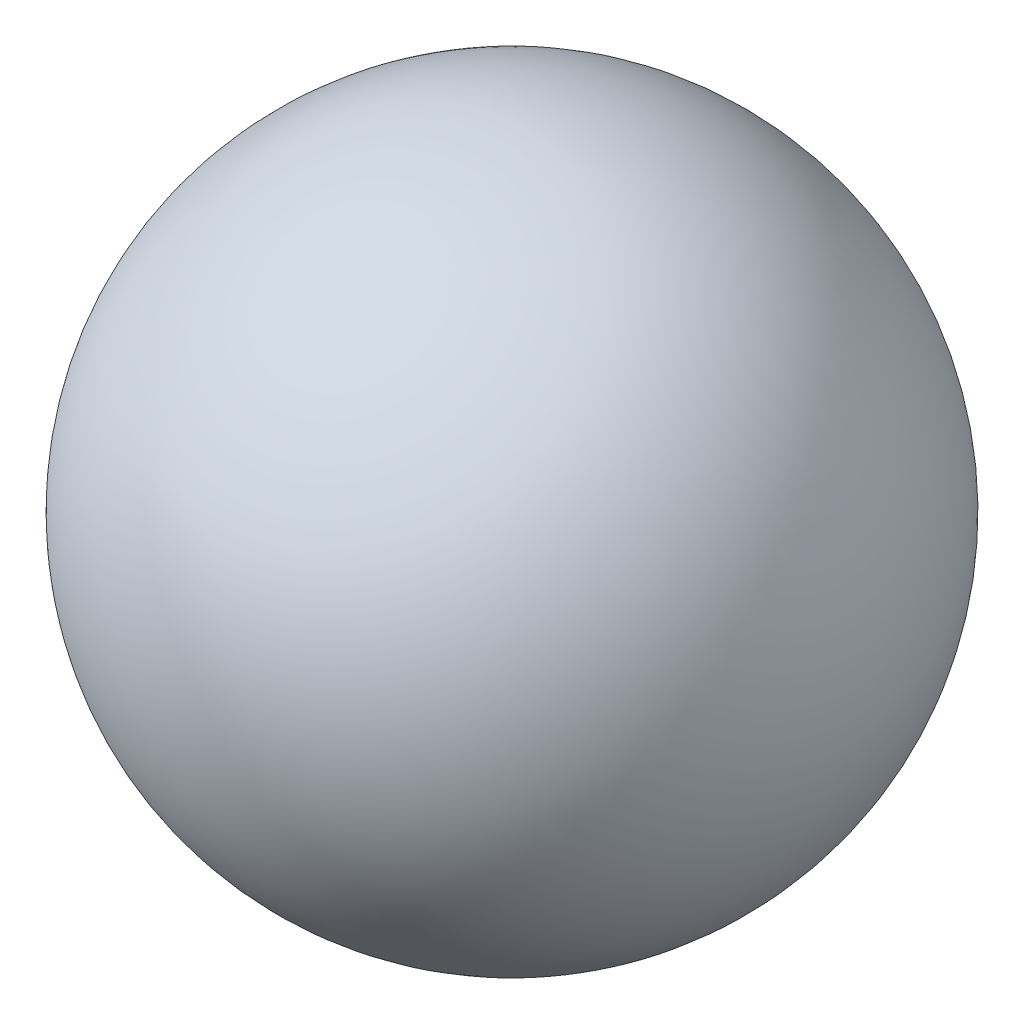
ISO-10303-21;
HEADER;
FILE_DESCRIPTION(('STEP AP214'),'2;1');
FILE_NAME('part.step','',(''),(''),'','','');
FILE_SCHEMA(('AUTOMOTIVE_DESIGN { 1 0 10303 214 1 1 1 1 }'));
ENDSEC;
DATA;
#1=APPLICATION_CONTEXT('core data for automotive mechanical design processes');
#2=APPLICATION_PROTOCOL_DEFINITION('international standard','automotive_design',2000,#1);
#3=PRODUCT_CONTEXT('',#1,'mechanical');
#4=PRODUCT('Part','Part','',(#3));
#5=PRODUCT_RELATED_PRODUCT_CATEGORY('part','',(#4));
#6=PRODUCT_DEFINITION_FORMATION('','',#4);
#7=PRODUCT_DEFINITION_CONTEXT('part definition',#1,'design');
#8=PRODUCT_DEFINITION('design','',#6,#7);
#9=PRODUCT_DEFINITION_SHAPE('','',#8);
#10=(LENGTH_UNIT() NAMED_UNIT(*) SI_UNIT(.MILLI.,.METRE.));
#11=(NAMED_UNIT(*) PLANE_ANGLE_UNIT() SI_UNIT($,.RADIAN.));
#12=(NAMED_UNIT(*) SI_UNIT($,.STERADIAN.) SOLID_ANGLE_UNIT());
#13=UNCERTAINTY_MEASURE_WITH_UNIT(LENGTH_MEASURE(1.E-05),#10,'distance_accuracy_value','');
#14=(GEOMETRIC_REPRESENTATION_CONTEXT(3) GLOBAL_UNCERTAINTY_ASSIGNED_CONTEXT((#13)) GLOBAL_UNIT_ASSIGNED_CONTEXT((#10,
#11,#12)) REPRESENTATION_CONTEXT('',''));
#15=CARTESIAN_POINT('',(0.,0.,0.));
#16=DIRECTION('',(0.,0.,1.));
#17=DIRECTION('',(1.,0.,0.));
#18=AXIS2_PLACEMENT_3D('',#15,#16,#17);
#19=CARTESIAN_POINT('',(5.90884651807326,1.04188906600089,2.));
#20=DIRECTION('',(0.173648177666917,-0.98480775301221,0.));
#21=DIRECTION('',(0.,0.,-1.));
#22=AXIS2_PLACEMENT_3D('',#19,#20,#21);
#23=SPHERICAL_SURFACE('',#22,1.04);
#24=CARTESIAN_POINT('',(5.72825241329967,2.06608912913359,2.));
#25=VERTEX_POINT('',#24);
#26=VERTEX_LOOP('',#25);
#27=FACE_BOUND('',#26,.T.);
#28=ADVANCED_FACE('F15',(#27),#23,.T.);
#29=CLOSED_SHELL('',(#28));
#30=MANIFOLD_SOLID_BREP('B1',#29);
#31=ADVANCED_BREP_SHAPE_REPRESENTATION('',(#18,#30),#14);
#32=SHAPE_DEFINITION_REPRESENTATION(#9,#31);
ENDSEC;
END-ISO-10303-21;
